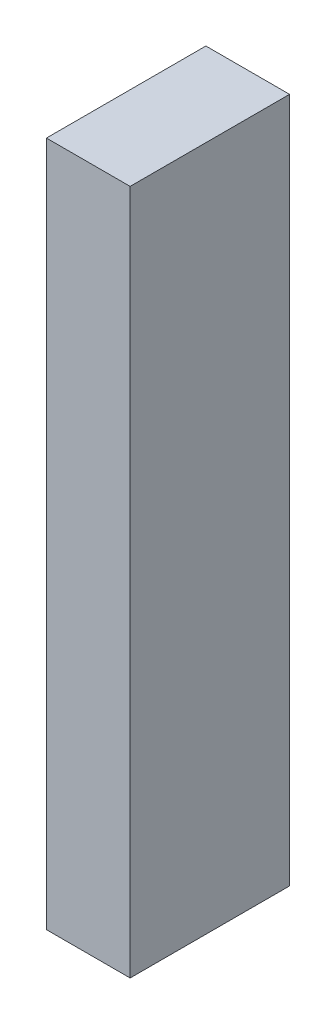
ISO-10303-21;
HEADER;
FILE_DESCRIPTION(('STEP AP214'),'2;1');
FILE_NAME('part.step','',(''),(''),'','','');
FILE_SCHEMA(('AUTOMOTIVE_DESIGN { 1 0 10303 214 1 1 1 1 }'));
ENDSEC;
DATA;
#1=APPLICATION_CONTEXT('core data for automotive mechanical design processes');
#2=APPLICATION_PROTOCOL_DEFINITION('international standard','automotive_design',2000,#1);
#3=PRODUCT_CONTEXT('',#1,'mechanical');
#4=PRODUCT('Part','Part','',(#3));
#5=PRODUCT_RELATED_PRODUCT_CATEGORY('part','',(#4));
#6=PRODUCT_DEFINITION_FORMATION('','',#4);
#7=PRODUCT_DEFINITION_CONTEXT('part definition',#1,'design');
#8=PRODUCT_DEFINITION('design','',#6,#7);
#9=PRODUCT_DEFINITION_SHAPE('','',#8);
#10=(LENGTH_UNIT() NAMED_UNIT(*) SI_UNIT(.MILLI.,.METRE.));
#11=(NAMED_UNIT(*) PLANE_ANGLE_UNIT() SI_UNIT($,.RADIAN.));
#12=(NAMED_UNIT(*) SI_UNIT($,.STERADIAN.) SOLID_ANGLE_UNIT());
#13=UNCERTAINTY_MEASURE_WITH_UNIT(LENGTH_MEASURE(1.E-05),#10,'distance_accuracy_value','');
#14=(GEOMETRIC_REPRESENTATION_CONTEXT(3) GLOBAL_UNCERTAINTY_ASSIGNED_CONTEXT((#13)) GLOBAL_UNIT_ASSIGNED_CONTEXT((#10,
#11,#12)) REPRESENTATION_CONTEXT('',''));
#15=CARTESIAN_POINT('',(0.,0.,0.));
#16=DIRECTION('',(0.,0.,1.));
#17=DIRECTION('',(1.,0.,0.));
#18=AXIS2_PLACEMENT_3D('',#15,#16,#17);
#19=CARTESIAN_POINT('',(21.,86.,20.));
#20=DIRECTION('',(0.,0.,-1.));
#21=DIRECTION('',(-1.,0.,0.));
#22=AXIS2_PLACEMENT_3D('',#19,#20,#21);
#23=PLANE('',#22);
#24=DIRECTION('',(0.,-1.,0.));
#25=VECTOR('',#24,1.);
#26=CARTESIAN_POINT('',(0.,86.,20.));
#27=LINE('',#26,#25);
#28=CARTESIAN_POINT('',(0.,86.,20.));
#29=VERTEX_POINT('',#28);
#30=CARTESIAN_POINT('',(0.,-86.,20.));
#31=VERTEX_POINT('',#30);
#32=EDGE_CURVE('E107',#29,#31,#27,.T.);
#33=ORIENTED_EDGE('',*,*,#32,.T.);
#34=DIRECTION('',(-1.,0.,0.));
#35=VECTOR('',#34,1.);
#36=CARTESIAN_POINT('',(21.,-86.,20.));
#37=LINE('',#36,#35);
#38=CARTESIAN_POINT('',(21.,-86.,20.));
#39=VERTEX_POINT('',#38);
#40=EDGE_CURVE('E11',#39,#31,#37,.T.);
#41=ORIENTED_EDGE('',*,*,#40,.F.);
#42=DIRECTION('',(0.,-1.,0.));
#43=VECTOR('',#42,1.);
#44=CARTESIAN_POINT('',(21.,86.,20.));
#45=LINE('',#44,#43);
#46=CARTESIAN_POINT('',(21.,86.,20.));
#47=VERTEX_POINT('',#46);
#48=EDGE_CURVE('E89',#47,#39,#45,.T.);
#49=ORIENTED_EDGE('',*,*,#48,.F.);
#50=DIRECTION('',(-1.,0.,0.));
#51=VECTOR('',#50,1.);
#52=CARTESIAN_POINT('',(21.,86.,20.));
#53=LINE('',#52,#51);
#54=EDGE_CURVE('E56',#47,#29,#53,.T.);
#55=ORIENTED_EDGE('',*,*,#54,.T.);
#56=EDGE_LOOP('',(#33,#41,#49,#55));
#57=FACE_BOUND('',#56,.T.);
#58=ADVANCED_FACE('F39',(#57),#23,.F.);
#59=CARTESIAN_POINT('',(21.,-86.,20.));
#60=DIRECTION('',(0.,1.,0.));
#61=DIRECTION('',(0.,0.,1.));
#62=AXIS2_PLACEMENT_3D('',#59,#60,#61);
#63=PLANE('',#62);
#64=DIRECTION('',(0.,0.,-1.));
#65=VECTOR('',#64,1.);
#66=CARTESIAN_POINT('',(0.,-86.,20.));
#67=LINE('',#66,#65);
#68=CARTESIAN_POINT('',(0.,-86.,-20.));
#69=VERTEX_POINT('',#68);
#70=EDGE_CURVE('E95',#31,#69,#67,.T.);
#71=ORIENTED_EDGE('',*,*,#70,.T.);
#72=DIRECTION('',(-1.,0.,0.));
#73=VECTOR('',#72,1.);
#74=CARTESIAN_POINT('',(21.,-86.,-20.));
#75=LINE('',#74,#73);
#76=CARTESIAN_POINT('',(21.,-86.,-20.));
#77=VERTEX_POINT('',#76);
#78=EDGE_CURVE('E48',#77,#69,#75,.T.);
#79=ORIENTED_EDGE('',*,*,#78,.F.);
#80=DIRECTION('',(0.,0.,-1.));
#81=VECTOR('',#80,1.);
#82=CARTESIAN_POINT('',(21.,-86.,20.));
#83=LINE('',#82,#81);
#84=EDGE_CURVE('E81',#39,#77,#83,.T.);
#85=ORIENTED_EDGE('',*,*,#84,.F.);
#86=ORIENTED_EDGE('',*,*,#40,.T.);
#87=EDGE_LOOP('',(#71,#79,#85,#86));
#88=FACE_BOUND('',#87,.T.);
#89=ADVANCED_FACE('F94',(#88),#63,.F.);
#90=CARTESIAN_POINT('',(21.,86.,-20.));
#91=DIRECTION('',(0.,0.,-1.));
#92=DIRECTION('',(-1.,0.,0.));
#93=AXIS2_PLACEMENT_3D('',#90,#91,#92);
#94=PLANE('',#93);
#95=DIRECTION('',(0.,-1.,0.));
#96=VECTOR('',#95,1.);
#97=CARTESIAN_POINT('',(0.,86.,-20.));
#98=LINE('',#97,#96);
#99=CARTESIAN_POINT('',(0.,86.,-20.));
#100=VERTEX_POINT('',#99);
#101=EDGE_CURVE('E112',#100,#69,#98,.T.);
#102=ORIENTED_EDGE('',*,*,#101,.F.);
#103=DIRECTION('',(-1.,0.,0.));
#104=VECTOR('',#103,1.);
#105=CARTESIAN_POINT('',(21.,86.,-20.));
#106=LINE('',#105,#104);
#107=CARTESIAN_POINT('',(21.,86.,-20.));
#108=VERTEX_POINT('',#107);
#109=EDGE_CURVE('E70',#108,#100,#106,.T.);
#110=ORIENTED_EDGE('',*,*,#109,.F.);
#111=DIRECTION('',(0.,-1.,0.));
#112=VECTOR('',#111,1.);
#113=CARTESIAN_POINT('',(21.,86.,-20.));
#114=LINE('',#113,#112);
#115=EDGE_CURVE('E88',#108,#77,#114,.T.);
#116=ORIENTED_EDGE('',*,*,#115,.T.);
#117=ORIENTED_EDGE('',*,*,#78,.T.);
#118=EDGE_LOOP('',(#102,#110,#116,#117));
#119=FACE_BOUND('',#118,.T.);
#120=ADVANCED_FACE('F99',(#119),#94,.T.);
#121=CARTESIAN_POINT('',(21.,86.,20.));
#122=DIRECTION('',(0.,1.,0.));
#123=DIRECTION('',(0.,0.,1.));
#124=AXIS2_PLACEMENT_3D('',#121,#122,#123);
#125=PLANE('',#124);
#126=DIRECTION('',(0.,0.,-1.));
#127=VECTOR('',#126,1.);
#128=CARTESIAN_POINT('',(0.,86.,20.));
#129=LINE('',#128,#127);
#130=EDGE_CURVE('E115',#29,#100,#129,.T.);
#131=ORIENTED_EDGE('',*,*,#130,.F.);
#132=ORIENTED_EDGE('',*,*,#54,.F.);
#133=DIRECTION('',(0.,0.,-1.));
#134=VECTOR('',#133,1.);
#135=CARTESIAN_POINT('',(21.,86.,20.));
#136=LINE('',#135,#134);
#137=EDGE_CURVE('E101',#47,#108,#136,.T.);
#138=ORIENTED_EDGE('',*,*,#137,.T.);
#139=ORIENTED_EDGE('',*,*,#109,.T.);
#140=EDGE_LOOP('',(#131,#132,#138,#139));
#141=FACE_BOUND('',#140,.T.);
#142=ADVANCED_FACE('F125',(#141),#125,.T.);
#143=CARTESIAN_POINT('',(21.,0.,0.));
#144=DIRECTION('',(1.,0.,0.));
#145=DIRECTION('',(0.,0.,-1.));
#146=AXIS2_PLACEMENT_3D('',#143,#144,#145);
#147=PLANE('',#146);
#148=ORIENTED_EDGE('',*,*,#48,.T.);
#149=ORIENTED_EDGE('',*,*,#84,.T.);
#150=ORIENTED_EDGE('',*,*,#115,.F.);
#151=ORIENTED_EDGE('',*,*,#137,.F.);
#152=EDGE_LOOP('',(#148,#149,#150,#151));
#153=FACE_BOUND('',#152,.T.);
#154=ADVANCED_FACE('F85',(#153),#147,.T.);
#155=CARTESIAN_POINT('',(0.,0.,0.));
#156=DIRECTION('',(1.,0.,0.));
#157=DIRECTION('',(0.,0.,-1.));
#158=AXIS2_PLACEMENT_3D('',#155,#156,#157);
#159=PLANE('',#158);
#160=ORIENTED_EDGE('',*,*,#32,.F.);
#161=ORIENTED_EDGE('',*,*,#130,.T.);
#162=ORIENTED_EDGE('',*,*,#101,.T.);
#163=ORIENTED_EDGE('',*,*,#70,.F.);
#164=EDGE_LOOP('',(#160,#161,#162,#163));
#165=FACE_BOUND('',#164,.T.);
#166=ADVANCED_FACE('F124',(#165),#159,.F.);
#167=CLOSED_SHELL('',(#58,#89,#120,#142,#154,#166));
#168=MANIFOLD_SOLID_BREP('B2',#167);
#169=ADVANCED_BREP_SHAPE_REPRESENTATION('',(#18,#168),#14);
#170=SHAPE_DEFINITION_REPRESENTATION(#9,#169);
ENDSEC;
END-ISO-10303-21;
